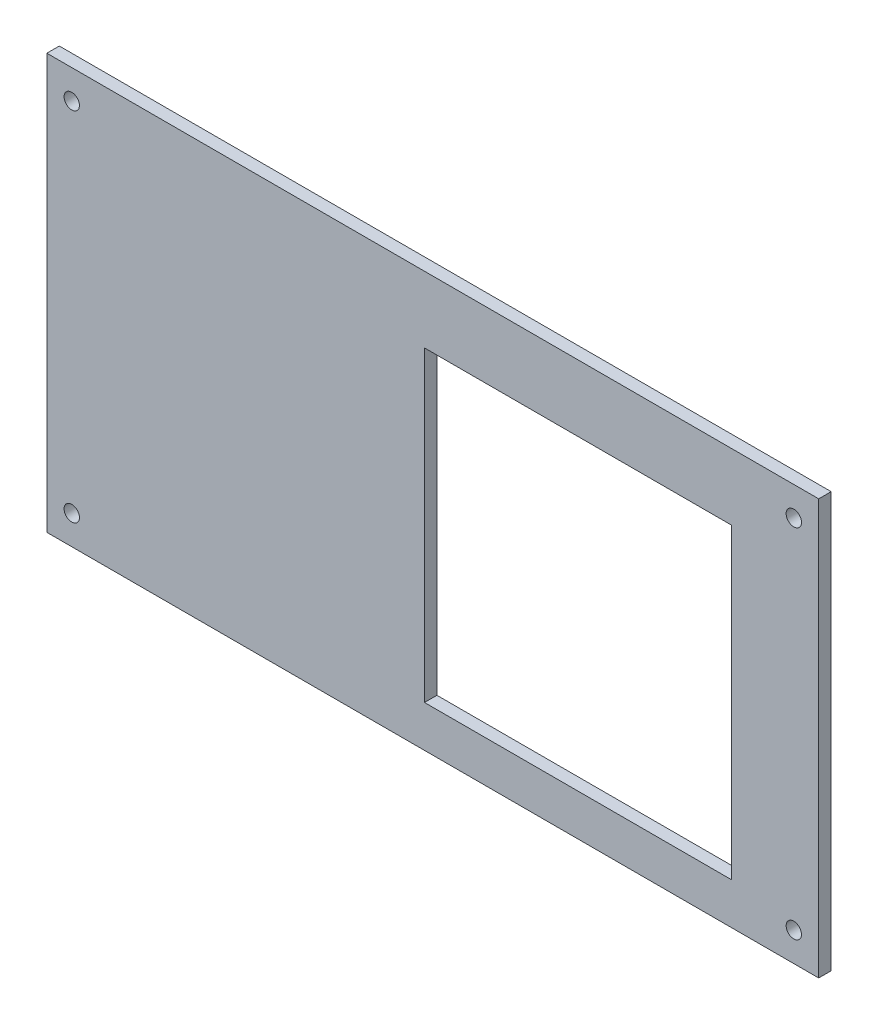
ISO-10303-21;
HEADER;
FILE_DESCRIPTION(('STEP AP214'),'2;1');
FILE_NAME('part.step','',(''),(''),'','','');
FILE_SCHEMA(('AUTOMOTIVE_DESIGN { 1 0 10303 214 1 1 1 1 }'));
ENDSEC;
DATA;
#1=APPLICATION_CONTEXT('core data for automotive mechanical design processes');
#2=APPLICATION_PROTOCOL_DEFINITION('international standard','automotive_design',2000,#1);
#3=PRODUCT_CONTEXT('',#1,'mechanical');
#4=PRODUCT('Part','Part','',(#3));
#5=PRODUCT_RELATED_PRODUCT_CATEGORY('part','',(#4));
#6=PRODUCT_DEFINITION_FORMATION('','',#4);
#7=PRODUCT_DEFINITION_CONTEXT('part definition',#1,'design');
#8=PRODUCT_DEFINITION('design','',#6,#7);
#9=PRODUCT_DEFINITION_SHAPE('','',#8);
#10=(LENGTH_UNIT() NAMED_UNIT(*) SI_UNIT(.MILLI.,.METRE.));
#11=(NAMED_UNIT(*) PLANE_ANGLE_UNIT() SI_UNIT($,.RADIAN.));
#12=(NAMED_UNIT(*) SI_UNIT($,.STERADIAN.) SOLID_ANGLE_UNIT());
#13=UNCERTAINTY_MEASURE_WITH_UNIT(LENGTH_MEASURE(1.E-05),#10,'distance_accuracy_value','');
#14=(GEOMETRIC_REPRESENTATION_CONTEXT(3) GLOBAL_UNCERTAINTY_ASSIGNED_CONTEXT((#13)) GLOBAL_UNIT_ASSIGNED_CONTEXT((#10,
#11,#12)) REPRESENTATION_CONTEXT('',''));
#15=CARTESIAN_POINT('',(0.,0.,0.));
#16=DIRECTION('',(0.,0.,1.));
#17=DIRECTION('',(1.,0.,0.));
#18=AXIS2_PLACEMENT_3D('',#15,#16,#17);
#19=CARTESIAN_POINT('',(0.,0.,3.));
#20=DIRECTION('',(1.,0.,0.));
#21=DIRECTION('',(0.,0.,-1.));
#22=AXIS2_PLACEMENT_3D('',#19,#20,#21);
#23=PLANE('',#22);
#24=DIRECTION('',(0.,-1.,0.));
#25=VECTOR('',#24,1.);
#26=CARTESIAN_POINT('',(0.,0.,0.));
#27=LINE('',#26,#25);
#28=CARTESIAN_POINT('',(0.,100.,0.));
#29=VERTEX_POINT('',#28);
#30=CARTESIAN_POINT('',(0.,0.,0.));
#31=VERTEX_POINT('',#30);
#32=EDGE_CURVE('E131',#29,#31,#27,.T.);
#33=ORIENTED_EDGE('',*,*,#32,.T.);
#34=DIRECTION('',(0.,0.,-1.));
#35=VECTOR('',#34,1.);
#36=CARTESIAN_POINT('',(0.,0.,3.));
#37=LINE('',#36,#35);
#38=CARTESIAN_POINT('',(0.,0.,3.));
#39=VERTEX_POINT('',#38);
#40=EDGE_CURVE('E11',#39,#31,#37,.T.);
#41=ORIENTED_EDGE('',*,*,#40,.F.);
#42=DIRECTION('',(0.,-1.,0.));
#43=VECTOR('',#42,1.);
#44=CARTESIAN_POINT('',(0.,0.,3.));
#45=LINE('',#44,#43);
#46=CARTESIAN_POINT('',(0.,100.,3.));
#47=VERTEX_POINT('',#46);
#48=EDGE_CURVE('E135',#47,#39,#45,.T.);
#49=ORIENTED_EDGE('',*,*,#48,.F.);
#50=DIRECTION('',(0.,0.,-1.));
#51=VECTOR('',#50,1.);
#52=CARTESIAN_POINT('',(0.,100.,3.));
#53=LINE('',#52,#51);
#54=EDGE_CURVE('E145',#47,#29,#53,.T.);
#55=ORIENTED_EDGE('',*,*,#54,.T.);
#56=EDGE_LOOP('',(#33,#41,#49,#55));
#57=FACE_BOUND('',#56,.T.);
#58=ADVANCED_FACE('F32',(#57),#23,.F.);
#59=CARTESIAN_POINT('',(0.,0.,3.));
#60=DIRECTION('',(0.,1.,0.));
#61=DIRECTION('',(0.,0.,1.));
#62=AXIS2_PLACEMENT_3D('',#59,#60,#61);
#63=PLANE('',#62);
#64=DIRECTION('',(1.,0.,0.));
#65=VECTOR('',#64,1.);
#66=CARTESIAN_POINT('',(0.,0.,0.));
#67=LINE('',#66,#65);
#68=CARTESIAN_POINT('',(186.,0.,0.));
#69=VERTEX_POINT('',#68);
#70=EDGE_CURVE('E148',#31,#69,#67,.T.);
#71=ORIENTED_EDGE('',*,*,#70,.T.);
#72=DIRECTION('',(0.,0.,-1.));
#73=VECTOR('',#72,1.);
#74=CARTESIAN_POINT('',(186.,0.,3.));
#75=LINE('',#74,#73);
#76=CARTESIAN_POINT('',(186.,0.,3.));
#77=VERTEX_POINT('',#76);
#78=EDGE_CURVE('E39',#77,#69,#75,.T.);
#79=ORIENTED_EDGE('',*,*,#78,.F.);
#80=DIRECTION('',(1.,0.,0.));
#81=VECTOR('',#80,1.);
#82=CARTESIAN_POINT('',(0.,0.,3.));
#83=LINE('',#82,#81);
#84=EDGE_CURVE('E138',#39,#77,#83,.T.);
#85=ORIENTED_EDGE('',*,*,#84,.F.);
#86=ORIENTED_EDGE('',*,*,#40,.T.);
#87=EDGE_LOOP('',(#71,#79,#85,#86));
#88=FACE_BOUND('',#87,.T.);
#89=ADVANCED_FACE('F176',(#88),#63,.F.);
#90=CARTESIAN_POINT('',(186.,0.,3.));
#91=DIRECTION('',(-1.,0.,0.));
#92=DIRECTION('',(0.,0.,1.));
#93=AXIS2_PLACEMENT_3D('',#90,#91,#92);
#94=PLANE('',#93);
#95=DIRECTION('',(0.,1.,0.));
#96=VECTOR('',#95,1.);
#97=CARTESIAN_POINT('',(186.,0.,0.));
#98=LINE('',#97,#96);
#99=CARTESIAN_POINT('',(186.,100.,0.));
#100=VERTEX_POINT('',#99);
#101=EDGE_CURVE('E150',#69,#100,#98,.T.);
#102=ORIENTED_EDGE('',*,*,#101,.T.);
#103=DIRECTION('',(0.,0.,-1.));
#104=VECTOR('',#103,1.);
#105=CARTESIAN_POINT('',(186.,100.,3.));
#106=LINE('',#105,#104);
#107=CARTESIAN_POINT('',(186.,100.,3.));
#108=VERTEX_POINT('',#107);
#109=EDGE_CURVE('E155',#108,#100,#106,.T.);
#110=ORIENTED_EDGE('',*,*,#109,.F.);
#111=DIRECTION('',(0.,1.,0.));
#112=VECTOR('',#111,1.);
#113=CARTESIAN_POINT('',(186.,0.,3.));
#114=LINE('',#113,#112);
#115=EDGE_CURVE('E141',#77,#108,#114,.T.);
#116=ORIENTED_EDGE('',*,*,#115,.F.);
#117=ORIENTED_EDGE('',*,*,#78,.T.);
#118=EDGE_LOOP('',(#102,#110,#116,#117));
#119=FACE_BOUND('',#118,.T.);
#120=ADVANCED_FACE('F162',(#119),#94,.F.);
#121=CARTESIAN_POINT('',(0.,100.,3.));
#122=DIRECTION('',(0.,-1.,0.));
#123=DIRECTION('',(0.,0.,-1.));
#124=AXIS2_PLACEMENT_3D('',#121,#122,#123);
#125=PLANE('',#124);
#126=DIRECTION('',(-1.,0.,0.));
#127=VECTOR('',#126,1.);
#128=CARTESIAN_POINT('',(0.,100.,0.));
#129=LINE('',#128,#127);
#130=EDGE_CURVE('E139',#100,#29,#129,.T.);
#131=ORIENTED_EDGE('',*,*,#130,.T.);
#132=ORIENTED_EDGE('',*,*,#54,.F.);
#133=DIRECTION('',(-1.,0.,0.));
#134=VECTOR('',#133,1.);
#135=CARTESIAN_POINT('',(0.,100.,3.));
#136=LINE('',#135,#134);
#137=EDGE_CURVE('E143',#108,#47,#136,.T.);
#138=ORIENTED_EDGE('',*,*,#137,.F.);
#139=ORIENTED_EDGE('',*,*,#109,.T.);
#140=EDGE_LOOP('',(#131,#132,#138,#139));
#141=FACE_BOUND('',#140,.T.);
#142=ADVANCED_FACE('F171',(#141),#125,.F.);
#143=CARTESIAN_POINT('',(0.,0.,3.));
#144=DIRECTION('',(0.,0.,-1.));
#145=DIRECTION('',(-1.,0.,0.));
#146=AXIS2_PLACEMENT_3D('',#143,#144,#145);
#147=PLANE('',#146);
#148=CARTESIAN_POINT('',(6.,93.,3.));
#149=DIRECTION('',(0.,0.,-1.));
#150=DIRECTION('',(-1.,0.,0.));
#151=AXIS2_PLACEMENT_3D('',#148,#149,#150);
#152=CIRCLE('',#151,1.85000000000001);
#153=CARTESIAN_POINT('',(4.14999999999999,93.,3.));
#154=VERTEX_POINT('',#153);
#155=EDGE_CURVE('E118',#154,#154,#152,.T.);
#156=ORIENTED_EDGE('',*,*,#155,.T.);
#157=EDGE_LOOP('',(#156));
#158=FACE_BOUND('',#157,.T.);
#159=CARTESIAN_POINT('',(6.,7.,3.));
#160=DIRECTION('',(0.,0.,-1.));
#161=DIRECTION('',(-1.,0.,0.));
#162=AXIS2_PLACEMENT_3D('',#159,#160,#161);
#163=CIRCLE('',#162,1.85);
#164=CARTESIAN_POINT('',(4.15,7.,3.));
#165=VERTEX_POINT('',#164);
#166=EDGE_CURVE('E240',#165,#165,#163,.T.);
#167=ORIENTED_EDGE('',*,*,#166,.T.);
#168=EDGE_LOOP('',(#167));
#169=FACE_BOUND('',#168,.T.);
#170=CARTESIAN_POINT('',(180.,93.,3.));
#171=DIRECTION('',(0.,0.,-1.));
#172=DIRECTION('',(-1.,0.,0.));
#173=AXIS2_PLACEMENT_3D('',#170,#171,#172);
#174=CIRCLE('',#173,1.85);
#175=CARTESIAN_POINT('',(178.15,93.,3.));
#176=VERTEX_POINT('',#175);
#177=EDGE_CURVE('E234',#176,#176,#174,.T.);
#178=ORIENTED_EDGE('',*,*,#177,.T.);
#179=EDGE_LOOP('',(#178));
#180=FACE_BOUND('',#179,.T.);
#181=CARTESIAN_POINT('',(180.,7.,3.));
#182=DIRECTION('',(0.,0.,-1.));
#183=DIRECTION('',(-1.,0.,0.));
#184=AXIS2_PLACEMENT_3D('',#181,#182,#183);
#185=CIRCLE('',#184,1.85);
#186=CARTESIAN_POINT('',(178.15,7.,3.));
#187=VERTEX_POINT('',#186);
#188=EDGE_CURVE('E224',#187,#187,#185,.T.);
#189=ORIENTED_EDGE('',*,*,#188,.T.);
#190=EDGE_LOOP('',(#189));
#191=FACE_BOUND('',#190,.T.);
#192=DIRECTION('',(0.,1.,0.));
#193=VECTOR('',#192,1.);
#194=CARTESIAN_POINT('',(165.,0.,3.));
#195=LINE('',#194,#193);
#196=CARTESIAN_POINT('',(165.,10.,3.));
#197=VERTEX_POINT('',#196);
#198=CARTESIAN_POINT('',(165.,84.,3.));
#199=VERTEX_POINT('',#198);
#200=EDGE_CURVE('E101',#197,#199,#195,.T.);
#201=ORIENTED_EDGE('',*,*,#200,.F.);
#202=DIRECTION('',(-1.,0.,0.));
#203=VECTOR('',#202,1.);
#204=CARTESIAN_POINT('',(0.,10.,3.));
#205=LINE('',#204,#203);
#206=CARTESIAN_POINT('',(91.,10.,3.));
#207=VERTEX_POINT('',#206);
#208=EDGE_CURVE('E98',#197,#207,#205,.T.);
#209=ORIENTED_EDGE('',*,*,#208,.T.);
#210=DIRECTION('',(0.,1.,0.));
#211=VECTOR('',#210,1.);
#212=CARTESIAN_POINT('',(91.,0.,3.));
#213=LINE('',#212,#211);
#214=CARTESIAN_POINT('',(91.,84.,3.));
#215=VERTEX_POINT('',#214);
#216=EDGE_CURVE('E104',#207,#215,#213,.T.);
#217=ORIENTED_EDGE('',*,*,#216,.T.);
#218=DIRECTION('',(-1.,0.,0.));
#219=VECTOR('',#218,1.);
#220=CARTESIAN_POINT('',(0.,84.,3.));
#221=LINE('',#220,#219);
#222=EDGE_CURVE('E108',#199,#215,#221,.T.);
#223=ORIENTED_EDGE('',*,*,#222,.F.);
#224=EDGE_LOOP('',(#201,#209,#217,#223));
#225=FACE_BOUND('',#224,.T.);
#226=ORIENTED_EDGE('',*,*,#48,.T.);
#227=ORIENTED_EDGE('',*,*,#84,.T.);
#228=ORIENTED_EDGE('',*,*,#115,.T.);
#229=ORIENTED_EDGE('',*,*,#137,.T.);
#230=EDGE_LOOP('',(#226,#227,#228,#229));
#231=FACE_BOUND('',#230,.T.);
#232=ADVANCED_FACE('F110',(#158,#169,#180,#191,#225,#231),#147,.F.);
#233=CARTESIAN_POINT('',(0.,0.,0.));
#234=DIRECTION('',(0.,0.,-1.));
#235=DIRECTION('',(-1.,0.,0.));
#236=AXIS2_PLACEMENT_3D('',#233,#234,#235);
#237=PLANE('',#236);
#238=CARTESIAN_POINT('',(6.,93.,0.));
#239=DIRECTION('',(0.,0.,-1.));
#240=DIRECTION('',(-1.,0.,0.));
#241=AXIS2_PLACEMENT_3D('',#238,#239,#240);
#242=CIRCLE('',#241,1.85000000000001);
#243=CARTESIAN_POINT('',(4.14999999999999,93.,0.));
#244=VERTEX_POINT('',#243);
#245=EDGE_CURVE('E242',#244,#244,#242,.T.);
#246=ORIENTED_EDGE('',*,*,#245,.F.);
#247=EDGE_LOOP('',(#246));
#248=FACE_BOUND('',#247,.T.);
#249=CARTESIAN_POINT('',(6.,7.,0.));
#250=DIRECTION('',(0.,0.,-1.));
#251=DIRECTION('',(-1.,0.,0.));
#252=AXIS2_PLACEMENT_3D('',#249,#250,#251);
#253=CIRCLE('',#252,1.85);
#254=CARTESIAN_POINT('',(4.15,7.,0.));
#255=VERTEX_POINT('',#254);
#256=EDGE_CURVE('E237',#255,#255,#253,.T.);
#257=ORIENTED_EDGE('',*,*,#256,.F.);
#258=EDGE_LOOP('',(#257));
#259=FACE_BOUND('',#258,.T.);
#260=CARTESIAN_POINT('',(180.,93.,0.));
#261=DIRECTION('',(0.,0.,-1.));
#262=DIRECTION('',(-1.,0.,0.));
#263=AXIS2_PLACEMENT_3D('',#260,#261,#262);
#264=CIRCLE('',#263,1.85);
#265=CARTESIAN_POINT('',(178.15,93.,0.));
#266=VERTEX_POINT('',#265);
#267=EDGE_CURVE('E229',#266,#266,#264,.T.);
#268=ORIENTED_EDGE('',*,*,#267,.F.);
#269=EDGE_LOOP('',(#268));
#270=FACE_BOUND('',#269,.T.);
#271=CARTESIAN_POINT('',(180.,7.,0.));
#272=DIRECTION('',(0.,0.,-1.));
#273=DIRECTION('',(-1.,0.,0.));
#274=AXIS2_PLACEMENT_3D('',#271,#272,#273);
#275=CIRCLE('',#274,1.85);
#276=CARTESIAN_POINT('',(178.15,7.,0.));
#277=VERTEX_POINT('',#276);
#278=EDGE_CURVE('E125',#277,#277,#275,.T.);
#279=ORIENTED_EDGE('',*,*,#278,.F.);
#280=EDGE_LOOP('',(#279));
#281=FACE_BOUND('',#280,.T.);
#282=DIRECTION('',(-1.,0.,0.));
#283=VECTOR('',#282,1.);
#284=CARTESIAN_POINT('',(0.,10.,0.));
#285=LINE('',#284,#283);
#286=CARTESIAN_POINT('',(165.,10.,0.));
#287=VERTEX_POINT('',#286);
#288=CARTESIAN_POINT('',(91.,10.,0.));
#289=VERTEX_POINT('',#288);
#290=EDGE_CURVE('E54',#287,#289,#285,.T.);
#291=ORIENTED_EDGE('',*,*,#290,.F.);
#292=DIRECTION('',(0.,1.,0.));
#293=VECTOR('',#292,1.);
#294=CARTESIAN_POINT('',(165.,0.,0.));
#295=LINE('',#294,#293);
#296=CARTESIAN_POINT('',(165.,84.,0.));
#297=VERTEX_POINT('',#296);
#298=EDGE_CURVE('E112',#287,#297,#295,.T.);
#299=ORIENTED_EDGE('',*,*,#298,.T.);
#300=DIRECTION('',(-1.,0.,0.));
#301=VECTOR('',#300,1.);
#302=CARTESIAN_POINT('',(0.,84.,0.));
#303=LINE('',#302,#301);
#304=CARTESIAN_POINT('',(91.,84.,0.));
#305=VERTEX_POINT('',#304);
#306=EDGE_CURVE('E115',#297,#305,#303,.T.);
#307=ORIENTED_EDGE('',*,*,#306,.T.);
#308=DIRECTION('',(0.,1.,0.));
#309=VECTOR('',#308,1.);
#310=CARTESIAN_POINT('',(91.,0.,0.));
#311=LINE('',#310,#309);
#312=EDGE_CURVE('E124',#289,#305,#311,.T.);
#313=ORIENTED_EDGE('',*,*,#312,.F.);
#314=EDGE_LOOP('',(#291,#299,#307,#313));
#315=FACE_BOUND('',#314,.T.);
#316=ORIENTED_EDGE('',*,*,#32,.F.);
#317=ORIENTED_EDGE('',*,*,#130,.F.);
#318=ORIENTED_EDGE('',*,*,#101,.F.);
#319=ORIENTED_EDGE('',*,*,#70,.F.);
#320=EDGE_LOOP('',(#316,#317,#318,#319));
#321=FACE_BOUND('',#320,.T.);
#322=ADVANCED_FACE('F168',(#248,#259,#270,#281,#315,#321),#237,.T.);
#323=CARTESIAN_POINT('',(0.,10.,3.));
#324=DIRECTION('',(0.,-1.,0.));
#325=DIRECTION('',(0.,0.,-1.));
#326=AXIS2_PLACEMENT_3D('',#323,#324,#325);
#327=PLANE('',#326);
#328=ORIENTED_EDGE('',*,*,#290,.T.);
#329=DIRECTION('',(0.,0.,-1.));
#330=VECTOR('',#329,1.);
#331=CARTESIAN_POINT('',(91.,10.,3.));
#332=LINE('',#331,#330);
#333=EDGE_CURVE('E95',#207,#289,#332,.T.);
#334=ORIENTED_EDGE('',*,*,#333,.F.);
#335=ORIENTED_EDGE('',*,*,#208,.F.);
#336=DIRECTION('',(0.,0.,-1.));
#337=VECTOR('',#336,1.);
#338=CARTESIAN_POINT('',(165.,10.,3.));
#339=LINE('',#338,#337);
#340=EDGE_CURVE('E129',#197,#287,#339,.T.);
#341=ORIENTED_EDGE('',*,*,#340,.T.);
#342=EDGE_LOOP('',(#328,#334,#335,#341));
#343=FACE_BOUND('',#342,.T.);
#344=ADVANCED_FACE('F96',(#343),#327,.F.);
#345=CARTESIAN_POINT('',(165.,0.,3.));
#346=DIRECTION('',(-1.,0.,0.));
#347=DIRECTION('',(0.,0.,1.));
#348=AXIS2_PLACEMENT_3D('',#345,#346,#347);
#349=PLANE('',#348);
#350=ORIENTED_EDGE('',*,*,#298,.F.);
#351=ORIENTED_EDGE('',*,*,#340,.F.);
#352=ORIENTED_EDGE('',*,*,#200,.T.);
#353=DIRECTION('',(0.,0.,-1.));
#354=VECTOR('',#353,1.);
#355=CARTESIAN_POINT('',(165.,84.,3.));
#356=LINE('',#355,#354);
#357=EDGE_CURVE('E132',#199,#297,#356,.T.);
#358=ORIENTED_EDGE('',*,*,#357,.T.);
#359=EDGE_LOOP('',(#350,#351,#352,#358));
#360=FACE_BOUND('',#359,.T.);
#361=ADVANCED_FACE('F194',(#360),#349,.T.);
#362=CARTESIAN_POINT('',(0.,84.,3.));
#363=DIRECTION('',(0.,-1.,0.));
#364=DIRECTION('',(0.,0.,-1.));
#365=AXIS2_PLACEMENT_3D('',#362,#363,#364);
#366=PLANE('',#365);
#367=ORIENTED_EDGE('',*,*,#306,.F.);
#368=ORIENTED_EDGE('',*,*,#357,.F.);
#369=ORIENTED_EDGE('',*,*,#222,.T.);
#370=DIRECTION('',(0.,0.,-1.));
#371=VECTOR('',#370,1.);
#372=CARTESIAN_POINT('',(91.,84.,3.));
#373=LINE('',#372,#371);
#374=EDGE_CURVE('E46',#215,#305,#373,.T.);
#375=ORIENTED_EDGE('',*,*,#374,.T.);
#376=EDGE_LOOP('',(#367,#368,#369,#375));
#377=FACE_BOUND('',#376,.T.);
#378=ADVANCED_FACE('F198',(#377),#366,.T.);
#379=CARTESIAN_POINT('',(91.,0.,3.));
#380=DIRECTION('',(-1.,0.,0.));
#381=DIRECTION('',(0.,0.,1.));
#382=AXIS2_PLACEMENT_3D('',#379,#380,#381);
#383=PLANE('',#382);
#384=ORIENTED_EDGE('',*,*,#312,.T.);
#385=ORIENTED_EDGE('',*,*,#374,.F.);
#386=ORIENTED_EDGE('',*,*,#216,.F.);
#387=ORIENTED_EDGE('',*,*,#333,.T.);
#388=EDGE_LOOP('',(#384,#385,#386,#387));
#389=FACE_BOUND('',#388,.T.);
#390=ADVANCED_FACE('F105',(#389),#383,.F.);
#391=CARTESIAN_POINT('',(180.,7.,3.));
#392=DIRECTION('',(0.,0.,-1.));
#393=DIRECTION('',(-1.,0.,0.));
#394=AXIS2_PLACEMENT_3D('',#391,#392,#393);
#395=CYLINDRICAL_SURFACE('',#394,1.85);
#396=ORIENTED_EDGE('',*,*,#188,.F.);
#397=EDGE_LOOP('',(#396));
#398=FACE_BOUND('',#397,.T.);
#399=ORIENTED_EDGE('',*,*,#278,.T.);
#400=EDGE_LOOP('',(#399));
#401=FACE_BOUND('',#400,.T.);
#402=ADVANCED_FACE('F197',(#398,#401),#395,.F.);
#403=CARTESIAN_POINT('',(180.,93.,3.));
#404=DIRECTION('',(0.,0.,-1.));
#405=DIRECTION('',(-1.,0.,0.));
#406=AXIS2_PLACEMENT_3D('',#403,#404,#405);
#407=CYLINDRICAL_SURFACE('',#406,1.85);
#408=ORIENTED_EDGE('',*,*,#177,.F.);
#409=EDGE_LOOP('',(#408));
#410=FACE_BOUND('',#409,.T.);
#411=ORIENTED_EDGE('',*,*,#267,.T.);
#412=EDGE_LOOP('',(#411));
#413=FACE_BOUND('',#412,.T.);
#414=ADVANCED_FACE('F212',(#410,#413),#407,.F.);
#415=CARTESIAN_POINT('',(6.,7.,3.));
#416=DIRECTION('',(0.,0.,-1.));
#417=DIRECTION('',(-1.,0.,0.));
#418=AXIS2_PLACEMENT_3D('',#415,#416,#417);
#419=CYLINDRICAL_SURFACE('',#418,1.85);
#420=ORIENTED_EDGE('',*,*,#166,.F.);
#421=EDGE_LOOP('',(#420));
#422=FACE_BOUND('',#421,.T.);
#423=ORIENTED_EDGE('',*,*,#256,.T.);
#424=EDGE_LOOP('',(#423));
#425=FACE_BOUND('',#424,.T.);
#426=ADVANCED_FACE('F208',(#422,#425),#419,.F.);
#427=CARTESIAN_POINT('',(6.,93.,3.));
#428=DIRECTION('',(0.,0.,-1.));
#429=DIRECTION('',(-1.,0.,0.));
#430=AXIS2_PLACEMENT_3D('',#427,#428,#429);
#431=CYLINDRICAL_SURFACE('',#430,1.85000000000001);
#432=ORIENTED_EDGE('',*,*,#155,.F.);
#433=EDGE_LOOP('',(#432));
#434=FACE_BOUND('',#433,.T.);
#435=ORIENTED_EDGE('',*,*,#245,.T.);
#436=EDGE_LOOP('',(#435));
#437=FACE_BOUND('',#436,.T.);
#438=ADVANCED_FACE('F205',(#434,#437),#431,.F.);
#439=CLOSED_SHELL('',(#58,#89,#120,#142,#232,#322,#344,#361,#378,#390,#402,#414,#426,#438));
#440=MANIFOLD_SOLID_BREP('B2',#439);
#441=ADVANCED_BREP_SHAPE_REPRESENTATION('',(#18,#440),#14);
#442=SHAPE_DEFINITION_REPRESENTATION(#9,#441);
ENDSEC;
END-ISO-10303-21;
